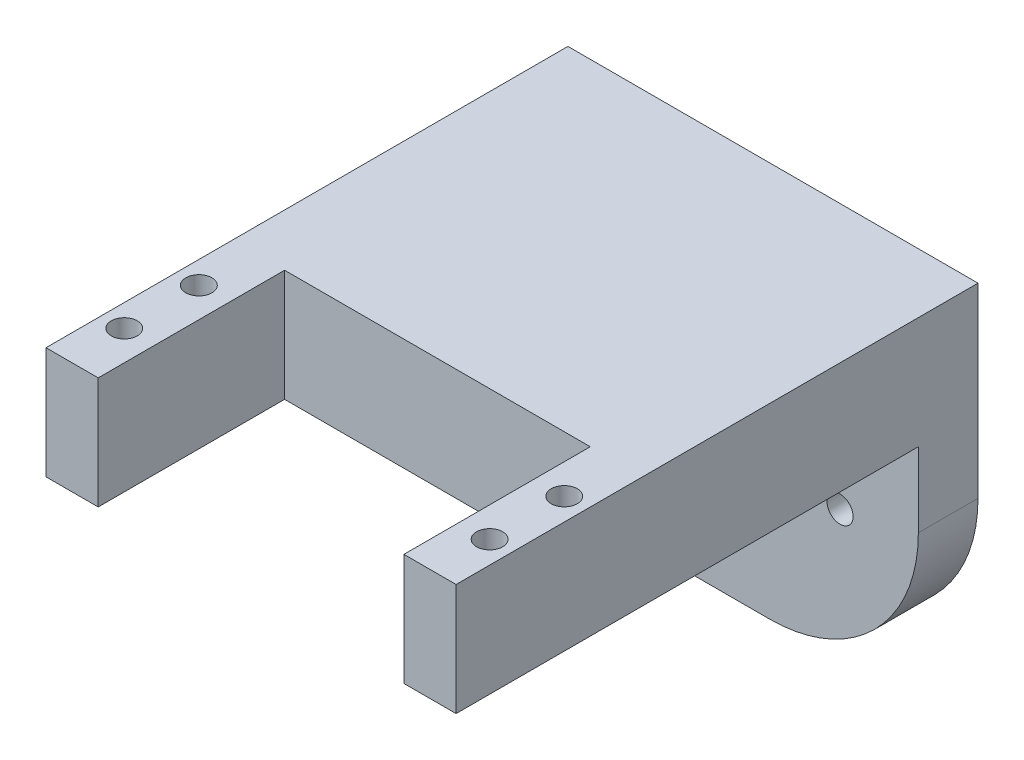
ISO-10303-21;
HEADER;
FILE_DESCRIPTION(('STEP AP214'),'2;1');
FILE_NAME('part.step','',(''),(''),'','','');
FILE_SCHEMA(('AUTOMOTIVE_DESIGN { 1 0 10303 214 1 1 1 1 }'));
ENDSEC;
DATA;
#1=APPLICATION_CONTEXT('core data for automotive mechanical design processes');
#2=APPLICATION_PROTOCOL_DEFINITION('international standard','automotive_design',2000,#1);
#3=PRODUCT_CONTEXT('',#1,'mechanical');
#4=PRODUCT('Part','Part','',(#3));
#5=PRODUCT_RELATED_PRODUCT_CATEGORY('part','',(#4));
#6=PRODUCT_DEFINITION_FORMATION('','',#4);
#7=PRODUCT_DEFINITION_CONTEXT('part definition',#1,'design');
#8=PRODUCT_DEFINITION('design','',#6,#7);
#9=PRODUCT_DEFINITION_SHAPE('','',#8);
#10=(LENGTH_UNIT() NAMED_UNIT(*) SI_UNIT(.MILLI.,.METRE.));
#11=(NAMED_UNIT(*) PLANE_ANGLE_UNIT() SI_UNIT($,.RADIAN.));
#12=(NAMED_UNIT(*) SI_UNIT($,.STERADIAN.) SOLID_ANGLE_UNIT());
#13=UNCERTAINTY_MEASURE_WITH_UNIT(LENGTH_MEASURE(1.E-05),#10,'distance_accuracy_value','');
#14=(GEOMETRIC_REPRESENTATION_CONTEXT(3) GLOBAL_UNCERTAINTY_ASSIGNED_CONTEXT((#13)) GLOBAL_UNIT_ASSIGNED_CONTEXT((#10,
#11,#12)) REPRESENTATION_CONTEXT('',''));
#15=CARTESIAN_POINT('',(0.,0.,0.));
#16=DIRECTION('',(0.,0.,1.));
#17=DIRECTION('',(1.,0.,0.));
#18=AXIS2_PLACEMENT_3D('',#15,#16,#17);
#19=CARTESIAN_POINT('',(0.,0.,70.));
#20=DIRECTION('',(0.,0.,1.));
#21=DIRECTION('',(1.,0.,0.));
#22=AXIS2_PLACEMENT_3D('',#19,#20,#21);
#23=PLANE('',#22);
#24=DIRECTION('',(0.,1.,0.));
#25=VECTOR('',#24,1.);
#26=CARTESIAN_POINT('',(20.5,7.5,70.));
#27=LINE('',#26,#25);
#28=CARTESIAN_POINT('',(20.5,-7.5,70.));
#29=VERTEX_POINT('',#28);
#30=CARTESIAN_POINT('',(20.5,7.5,70.));
#31=VERTEX_POINT('',#30);
#32=EDGE_CURVE('E282',#29,#31,#27,.T.);
#33=ORIENTED_EDGE('',*,*,#32,.F.);
#34=DIRECTION('',(1.,0.,0.));
#35=VECTOR('',#34,1.);
#36=CARTESIAN_POINT('',(-27.5,-7.5,70.));
#37=LINE('',#36,#35);
#38=CARTESIAN_POINT('',(27.5,-7.5,70.));
#39=VERTEX_POINT('',#38);
#40=EDGE_CURVE('E321',#29,#39,#37,.T.);
#41=ORIENTED_EDGE('',*,*,#40,.T.);
#42=DIRECTION('',(0.,1.,0.));
#43=VECTOR('',#42,1.);
#44=CARTESIAN_POINT('',(27.5,7.5,70.));
#45=LINE('',#44,#43);
#46=CARTESIAN_POINT('',(27.5,7.5,70.));
#47=VERTEX_POINT('',#46);
#48=EDGE_CURVE('E311',#39,#47,#45,.T.);
#49=ORIENTED_EDGE('',*,*,#48,.T.);
#50=DIRECTION('',(-1.,0.,0.));
#51=VECTOR('',#50,1.);
#52=CARTESIAN_POINT('',(-27.5,7.5,70.));
#53=LINE('',#52,#51);
#54=EDGE_CURVE('E316',#47,#31,#53,.T.);
#55=ORIENTED_EDGE('',*,*,#54,.T.);
#56=EDGE_LOOP('',(#33,#41,#49,#55));
#57=FACE_BOUND('',#56,.T.);
#58=ADVANCED_FACE('F37',(#57),#23,.T.);
#59=CARTESIAN_POINT('',(27.5,7.5,70.));
#60=DIRECTION('',(-1.,0.,0.));
#61=DIRECTION('',(0.,-1.,0.));
#62=AXIS2_PLACEMENT_3D('',#59,#60,#61);
#63=PLANE('',#62);
#64=DIRECTION('',(0.,1.,0.));
#65=VECTOR('',#64,1.);
#66=CARTESIAN_POINT('',(27.5,-37.5,8.));
#67=LINE('',#66,#65);
#68=CARTESIAN_POINT('',(27.5,-17.5,8.));
#69=VERTEX_POINT('',#68);
#70=CARTESIAN_POINT('',(27.5,-7.5,8.));
#71=VERTEX_POINT('',#70);
#72=EDGE_CURVE('E257',#69,#71,#67,.T.);
#73=ORIENTED_EDGE('',*,*,#72,.F.);
#74=DIRECTION('',(0.,0.,-1.));
#75=VECTOR('',#74,1.);
#76=CARTESIAN_POINT('',(27.5,-17.5,70.));
#77=LINE('',#76,#75);
#78=CARTESIAN_POINT('',(27.5,-17.5,0.));
#79=VERTEX_POINT('',#78);
#80=EDGE_CURVE('E342',#69,#79,#77,.T.);
#81=ORIENTED_EDGE('',*,*,#80,.T.);
#82=DIRECTION('',(0.,1.,0.));
#83=VECTOR('',#82,1.);
#84=CARTESIAN_POINT('',(27.5,7.5,0.));
#85=LINE('',#84,#83);
#86=CARTESIAN_POINT('',(27.5,7.5,0.));
#87=VERTEX_POINT('',#86);
#88=EDGE_CURVE('E303',#79,#87,#85,.T.);
#89=ORIENTED_EDGE('',*,*,#88,.T.);
#90=DIRECTION('',(0.,0.,-1.));
#91=VECTOR('',#90,1.);
#92=CARTESIAN_POINT('',(27.5,7.5,70.));
#93=LINE('',#92,#91);
#94=EDGE_CURVE('E339',#47,#87,#93,.T.);
#95=ORIENTED_EDGE('',*,*,#94,.F.);
#96=ORIENTED_EDGE('',*,*,#48,.F.);
#97=DIRECTION('',(0.,0.,-1.));
#98=VECTOR('',#97,1.);
#99=CARTESIAN_POINT('',(27.5,-7.5,70.));
#100=LINE('',#99,#98);
#101=EDGE_CURVE('E325',#39,#71,#100,.T.);
#102=ORIENTED_EDGE('',*,*,#101,.T.);
#103=EDGE_LOOP('',(#73,#81,#89,#95,#96,#102));
#104=FACE_BOUND('',#103,.T.);
#105=ADVANCED_FACE('F363',(#104),#63,.F.);
#106=CARTESIAN_POINT('',(-27.5,7.5,70.));
#107=DIRECTION('',(0.,-1.,0.));
#108=DIRECTION('',(0.,0.,-1.));
#109=AXIS2_PLACEMENT_3D('',#106,#107,#108);
#110=PLANE('',#109);
#111=CARTESIAN_POINT('',(24.5,7.5,62.5));
#112=DIRECTION('',(0.,1.,0.));
#113=DIRECTION('',(0.,0.,1.));
#114=AXIS2_PLACEMENT_3D('',#111,#112,#113);
#115=CIRCLE('',#114,1.75);
#116=CARTESIAN_POINT('',(24.5,7.5,64.25));
#117=VERTEX_POINT('',#116);
#118=EDGE_CURVE('E267',#117,#117,#115,.T.);
#119=ORIENTED_EDGE('',*,*,#118,.F.);
#120=EDGE_LOOP('',(#119));
#121=FACE_BOUND('',#120,.T.);
#122=CARTESIAN_POINT('',(-24.5,7.5,52.5));
#123=DIRECTION('',(0.,1.,0.));
#124=DIRECTION('',(0.,0.,1.));
#125=AXIS2_PLACEMENT_3D('',#122,#123,#124);
#126=CIRCLE('',#125,1.75);
#127=CARTESIAN_POINT('',(-24.5,7.5,54.25));
#128=VERTEX_POINT('',#127);
#129=EDGE_CURVE('E274',#128,#128,#126,.T.);
#130=ORIENTED_EDGE('',*,*,#129,.F.);
#131=EDGE_LOOP('',(#130));
#132=FACE_BOUND('',#131,.T.);
#133=CARTESIAN_POINT('',(24.5,7.5,52.5));
#134=DIRECTION('',(0.,1.,0.));
#135=DIRECTION('',(0.,0.,1.));
#136=AXIS2_PLACEMENT_3D('',#133,#134,#135);
#137=CIRCLE('',#136,1.75);
#138=CARTESIAN_POINT('',(24.5,7.5,54.25));
#139=VERTEX_POINT('',#138);
#140=EDGE_CURVE('E261',#139,#139,#137,.T.);
#141=ORIENTED_EDGE('',*,*,#140,.F.);
#142=EDGE_LOOP('',(#141));
#143=FACE_BOUND('',#142,.T.);
#144=CARTESIAN_POINT('',(-24.5,7.5,62.5));
#145=DIRECTION('',(0.,1.,0.));
#146=DIRECTION('',(0.,0.,1.));
#147=AXIS2_PLACEMENT_3D('',#144,#145,#146);
#148=CIRCLE('',#147,1.75);
#149=CARTESIAN_POINT('',(-24.5,7.5,64.25));
#150=VERTEX_POINT('',#149);
#151=EDGE_CURVE('E270',#150,#150,#148,.T.);
#152=ORIENTED_EDGE('',*,*,#151,.F.);
#153=EDGE_LOOP('',(#152));
#154=FACE_BOUND('',#153,.T.);
#155=DIRECTION('',(-1.,0.,0.));
#156=VECTOR('',#155,1.);
#157=CARTESIAN_POINT('',(-20.5,7.5,45.));
#158=LINE('',#157,#156);
#159=CARTESIAN_POINT('',(20.5,7.5,45.));
#160=VERTEX_POINT('',#159);
#161=CARTESIAN_POINT('',(-20.5,7.5,45.));
#162=VERTEX_POINT('',#161);
#163=EDGE_CURVE('E288',#160,#162,#158,.T.);
#164=ORIENTED_EDGE('',*,*,#163,.F.);
#165=DIRECTION('',(0.,0.,1.));
#166=VECTOR('',#165,1.);
#167=CARTESIAN_POINT('',(20.5,7.5,45.));
#168=LINE('',#167,#166);
#169=EDGE_CURVE('E298',#160,#31,#168,.T.);
#170=ORIENTED_EDGE('',*,*,#169,.T.);
#171=ORIENTED_EDGE('',*,*,#54,.F.);
#172=ORIENTED_EDGE('',*,*,#94,.T.);
#173=DIRECTION('',(-1.,0.,0.));
#174=VECTOR('',#173,1.);
#175=CARTESIAN_POINT('',(-27.5,7.5,0.));
#176=LINE('',#175,#174);
#177=CARTESIAN_POINT('',(-27.5,7.5,0.));
#178=VERTEX_POINT('',#177);
#179=EDGE_CURVE('E327',#87,#178,#176,.T.);
#180=ORIENTED_EDGE('',*,*,#179,.T.);
#181=DIRECTION('',(0.,0.,-1.));
#182=VECTOR('',#181,1.);
#183=CARTESIAN_POINT('',(-27.5,7.5,70.));
#184=LINE('',#183,#182);
#185=CARTESIAN_POINT('',(-27.5,7.5,70.));
#186=VERTEX_POINT('',#185);
#187=EDGE_CURVE('E336',#186,#178,#184,.T.);
#188=ORIENTED_EDGE('',*,*,#187,.F.);
#189=CARTESIAN_POINT('',(-20.5,7.5,70.));
#190=VERTEX_POINT('',#189);
#191=EDGE_CURVE('E314',#190,#186,#53,.T.);
#192=ORIENTED_EDGE('',*,*,#191,.F.);
#193=DIRECTION('',(0.,0.,1.));
#194=VECTOR('',#193,1.);
#195=CARTESIAN_POINT('',(-20.5,7.5,45.));
#196=LINE('',#195,#194);
#197=EDGE_CURVE('E307',#162,#190,#196,.T.);
#198=ORIENTED_EDGE('',*,*,#197,.F.);
#199=EDGE_LOOP('',(#164,#170,#171,#172,#180,#188,#192,#198));
#200=FACE_BOUND('',#199,.T.);
#201=ADVANCED_FACE('F385',(#121,#132,#143,#154,#200),#110,.F.);
#202=CARTESIAN_POINT('',(-27.5,7.5,70.));
#203=DIRECTION('',(1.,0.,0.));
#204=DIRECTION('',(0.,1.,0.));
#205=AXIS2_PLACEMENT_3D('',#202,#203,#204);
#206=PLANE('',#205);
#207=DIRECTION('',(0.,-1.,0.));
#208=VECTOR('',#207,1.);
#209=CARTESIAN_POINT('',(-27.5,7.5,0.));
#210=LINE('',#209,#208);
#211=CARTESIAN_POINT('',(-27.5,-17.5,0.));
#212=VERTEX_POINT('',#211);
#213=EDGE_CURVE('E315',#178,#212,#210,.T.);
#214=ORIENTED_EDGE('',*,*,#213,.T.);
#215=DIRECTION('',(0.,0.,1.));
#216=VECTOR('',#215,1.);
#217=CARTESIAN_POINT('',(-27.5,-17.5,70.));
#218=LINE('',#217,#216);
#219=CARTESIAN_POINT('',(-27.5,-17.5,8.));
#220=VERTEX_POINT('',#219);
#221=EDGE_CURVE('E11',#212,#220,#218,.T.);
#222=ORIENTED_EDGE('',*,*,#221,.T.);
#223=DIRECTION('',(0.,1.,0.));
#224=VECTOR('',#223,1.);
#225=CARTESIAN_POINT('',(-27.5,-37.5,8.));
#226=LINE('',#225,#224);
#227=CARTESIAN_POINT('',(-27.5,-7.5,8.));
#228=VERTEX_POINT('',#227);
#229=EDGE_CURVE('E254',#220,#228,#226,.T.);
#230=ORIENTED_EDGE('',*,*,#229,.T.);
#231=DIRECTION('',(0.,0.,-1.));
#232=VECTOR('',#231,1.);
#233=CARTESIAN_POINT('',(-27.5,-7.5,70.));
#234=LINE('',#233,#232);
#235=CARTESIAN_POINT('',(-27.5,-7.5,70.));
#236=VERTEX_POINT('',#235);
#237=EDGE_CURVE('E333',#236,#228,#234,.T.);
#238=ORIENTED_EDGE('',*,*,#237,.F.);
#239=DIRECTION('',(0.,-1.,0.));
#240=VECTOR('',#239,1.);
#241=CARTESIAN_POINT('',(-27.5,7.5,70.));
#242=LINE('',#241,#240);
#243=EDGE_CURVE('E319',#186,#236,#242,.T.);
#244=ORIENTED_EDGE('',*,*,#243,.F.);
#245=ORIENTED_EDGE('',*,*,#187,.T.);
#246=EDGE_LOOP('',(#214,#222,#230,#238,#244,#245));
#247=FACE_BOUND('',#246,.T.);
#248=ADVANCED_FACE('F377',(#247),#206,.F.);
#249=CARTESIAN_POINT('',(-27.5,-7.5,70.));
#250=DIRECTION('',(0.,1.,0.));
#251=DIRECTION('',(0.,0.,1.));
#252=AXIS2_PLACEMENT_3D('',#249,#250,#251);
#253=PLANE('',#252);
#254=CARTESIAN_POINT('',(24.5,-7.5,62.5));
#255=DIRECTION('',(0.,1.,0.));
#256=DIRECTION('',(0.,0.,1.));
#257=AXIS2_PLACEMENT_3D('',#254,#255,#256);
#258=CIRCLE('',#257,1.75);
#259=CARTESIAN_POINT('',(24.5,-7.5,64.25));
#260=VERTEX_POINT('',#259);
#261=EDGE_CURVE('E271',#260,#260,#258,.T.);
#262=ORIENTED_EDGE('',*,*,#261,.T.);
#263=EDGE_LOOP('',(#262));
#264=FACE_BOUND('',#263,.T.);
#265=CARTESIAN_POINT('',(-24.5,-7.5,52.5));
#266=DIRECTION('',(0.,1.,0.));
#267=DIRECTION('',(0.,0.,1.));
#268=AXIS2_PLACEMENT_3D('',#265,#266,#267);
#269=CIRCLE('',#268,1.75);
#270=CARTESIAN_POINT('',(-24.5,-7.5,54.25));
#271=VERTEX_POINT('',#270);
#272=EDGE_CURVE('E264',#271,#271,#269,.T.);
#273=ORIENTED_EDGE('',*,*,#272,.T.);
#274=EDGE_LOOP('',(#273));
#275=FACE_BOUND('',#274,.T.);
#276=CARTESIAN_POINT('',(24.5,-7.5,52.5));
#277=DIRECTION('',(0.,1.,0.));
#278=DIRECTION('',(0.,0.,1.));
#279=AXIS2_PLACEMENT_3D('',#276,#277,#278);
#280=CIRCLE('',#279,1.75);
#281=CARTESIAN_POINT('',(24.5,-7.5,54.25));
#282=VERTEX_POINT('',#281);
#283=EDGE_CURVE('E259',#282,#282,#280,.T.);
#284=ORIENTED_EDGE('',*,*,#283,.T.);
#285=EDGE_LOOP('',(#284));
#286=FACE_BOUND('',#285,.T.);
#287=CARTESIAN_POINT('',(-24.5,-7.5,62.5));
#288=DIRECTION('',(0.,1.,0.));
#289=DIRECTION('',(0.,0.,1.));
#290=AXIS2_PLACEMENT_3D('',#287,#288,#289);
#291=CIRCLE('',#290,1.75);
#292=CARTESIAN_POINT('',(-24.5,-7.5,64.25));
#293=VERTEX_POINT('',#292);
#294=EDGE_CURVE('E279',#293,#293,#291,.T.);
#295=ORIENTED_EDGE('',*,*,#294,.T.);
#296=EDGE_LOOP('',(#295));
#297=FACE_BOUND('',#296,.T.);
#298=ORIENTED_EDGE('',*,*,#237,.T.);
#299=DIRECTION('',(1.,0.,0.));
#300=VECTOR('',#299,1.);
#301=CARTESIAN_POINT('',(-27.5,-7.5,8.));
#302=LINE('',#301,#300);
#303=EDGE_CURVE('E236',#228,#71,#302,.T.);
#304=ORIENTED_EDGE('',*,*,#303,.T.);
#305=ORIENTED_EDGE('',*,*,#101,.F.);
#306=ORIENTED_EDGE('',*,*,#40,.F.);
#307=DIRECTION('',(0.,0.,1.));
#308=VECTOR('',#307,1.);
#309=CARTESIAN_POINT('',(20.5,-7.5,45.));
#310=LINE('',#309,#308);
#311=CARTESIAN_POINT('',(20.5,-7.5,45.));
#312=VERTEX_POINT('',#311);
#313=EDGE_CURVE('E301',#312,#29,#310,.T.);
#314=ORIENTED_EDGE('',*,*,#313,.F.);
#315=DIRECTION('',(1.,0.,0.));
#316=VECTOR('',#315,1.);
#317=CARTESIAN_POINT('',(-20.5,-7.5,45.));
#318=LINE('',#317,#316);
#319=CARTESIAN_POINT('',(-20.5,-7.5,45.));
#320=VERTEX_POINT('',#319);
#321=EDGE_CURVE('E295',#320,#312,#318,.T.);
#322=ORIENTED_EDGE('',*,*,#321,.F.);
#323=DIRECTION('',(0.,0.,1.));
#324=VECTOR('',#323,1.);
#325=CARTESIAN_POINT('',(-20.5,-7.5,45.));
#326=LINE('',#325,#324);
#327=CARTESIAN_POINT('',(-20.5,-7.5,70.));
#328=VERTEX_POINT('',#327);
#329=EDGE_CURVE('E304',#320,#328,#326,.T.);
#330=ORIENTED_EDGE('',*,*,#329,.T.);
#331=EDGE_CURVE('E322',#236,#328,#37,.T.);
#332=ORIENTED_EDGE('',*,*,#331,.F.);
#333=EDGE_LOOP('',(#298,#304,#305,#306,#314,#322,#330,#332));
#334=FACE_BOUND('',#333,.T.);
#335=ADVANCED_FACE('F393',(#264,#275,#286,#297,#334),#253,.F.);
#336=DIRECTION('',(0.,-1.,0.));
#337=VECTOR('',#336,1.);
#338=CARTESIAN_POINT('',(-20.5,7.5,70.));
#339=LINE('',#338,#337);
#340=EDGE_CURVE('E289',#190,#328,#339,.T.);
#341=ORIENTED_EDGE('',*,*,#340,.F.);
#342=ORIENTED_EDGE('',*,*,#191,.T.);
#343=ORIENTED_EDGE('',*,*,#243,.T.);
#344=ORIENTED_EDGE('',*,*,#331,.T.);
#345=EDGE_LOOP('',(#341,#342,#343,#344));
#346=FACE_BOUND('',#345,.T.);
#347=ADVANCED_FACE('F398',(#346),#23,.T.);
#348=CARTESIAN_POINT('',(0.,0.,0.));
#349=DIRECTION('',(0.,0.,1.));
#350=DIRECTION('',(1.,0.,0.));
#351=AXIS2_PLACEMENT_3D('',#348,#349,#350);
#352=PLANE('',#351);
#353=DIRECTION('',(-0.984221987662164,-0.176938065441948,0.));
#354=VECTOR('',#353,1.);
#355=CARTESIAN_POINT('',(17.4777327766933,-22.6573993666878,0.));
#356=LINE('',#355,#354);
#357=CARTESIAN_POINT('',(17.4777327766933,-22.6573993666878,0.));
#358=VERTEX_POINT('',#357);
#359=CARTESIAN_POINT('',(3.3923680600744,-25.1895894775008,0.));
#360=VERTEX_POINT('',#359);
#361=EDGE_CURVE('E218',#358,#360,#356,.T.);
#362=ORIENTED_EDGE('',*,*,#361,.F.);
#363=CARTESIAN_POINT('',(17.,-20.,0.));
#364=DIRECTION('',(0.,0.,-1.));
#365=DIRECTION('',(-1.,0.,0.));
#366=AXIS2_PLACEMENT_3D('',#363,#364,#365);
#367=CIRCLE('',#366,2.7);
#368=CARTESIAN_POINT('',(17.4777327766933,-17.3426006333122,0.));
#369=VERTEX_POINT('',#368);
#370=EDGE_CURVE('E52',#369,#358,#367,.T.);
#371=ORIENTED_EDGE('',*,*,#370,.F.);
#372=DIRECTION('',(0.984221987662164,-0.176938065441948,0.));
#373=VECTOR('',#372,1.);
#374=CARTESIAN_POINT('',(17.4777327766933,-17.3426006333122,0.));
#375=LINE('',#374,#373);
#376=CARTESIAN_POINT('',(3.3923680600744,-14.8104105224992,0.));
#377=VERTEX_POINT('',#376);
#378=EDGE_CURVE('E195',#377,#369,#375,.T.);
#379=ORIENTED_EDGE('',*,*,#378,.F.);
#380=CARTESIAN_POINT('',(0.,-20.,0.));
#381=DIRECTION('',(0.,0.,-1.));
#382=DIRECTION('',(-1.,0.,0.));
#383=AXIS2_PLACEMENT_3D('',#380,#381,#382);
#384=CIRCLE('',#383,6.2);
#385=CARTESIAN_POINT('',(-3.39236806007439,-14.8104105224992,0.));
#386=VERTEX_POINT('',#385);
#387=EDGE_CURVE('E198',#386,#377,#384,.T.);
#388=ORIENTED_EDGE('',*,*,#387,.F.);
#389=DIRECTION('',(0.984221987662164,0.176938065441947,0.));
#390=VECTOR('',#389,1.);
#391=CARTESIAN_POINT('',(-17.4777327766933,-17.3426006333121,0.));
#392=LINE('',#391,#390);
#393=CARTESIAN_POINT('',(-17.4777327766933,-17.3426006333121,0.));
#394=VERTEX_POINT('',#393);
#395=EDGE_CURVE('E229',#394,#386,#392,.T.);
#396=ORIENTED_EDGE('',*,*,#395,.F.);
#397=CARTESIAN_POINT('',(-17.,-20.,0.));
#398=DIRECTION('',(0.,0.,-1.));
#399=DIRECTION('',(-1.,0.,0.));
#400=AXIS2_PLACEMENT_3D('',#397,#398,#399);
#401=CIRCLE('',#400,2.7);
#402=CARTESIAN_POINT('',(-17.4777327766933,-22.6573993666878,0.));
#403=VERTEX_POINT('',#402);
#404=EDGE_CURVE('E226',#403,#394,#401,.T.);
#405=ORIENTED_EDGE('',*,*,#404,.F.);
#406=DIRECTION('',(-0.984221987662164,0.176938065441948,0.));
#407=VECTOR('',#406,1.);
#408=CARTESIAN_POINT('',(-3.39236806007439,-25.1895894775008,0.));
#409=LINE('',#408,#407);
#410=CARTESIAN_POINT('',(-3.39236806007439,-25.1895894775008,0.));
#411=VERTEX_POINT('',#410);
#412=EDGE_CURVE('E223',#411,#403,#409,.T.);
#413=ORIENTED_EDGE('',*,*,#412,.F.);
#414=CARTESIAN_POINT('',(0.,-20.,0.));
#415=DIRECTION('',(0.,0.,-1.));
#416=DIRECTION('',(-1.,0.,0.));
#417=AXIS2_PLACEMENT_3D('',#414,#415,#416);
#418=CIRCLE('',#417,6.2);
#419=EDGE_CURVE('E220',#360,#411,#418,.T.);
#420=ORIENTED_EDGE('',*,*,#419,.F.);
#421=EDGE_LOOP('',(#362,#371,#379,#388,#396,#405,#413,#420));
#422=FACE_BOUND('',#421,.T.);
#423=ORIENTED_EDGE('',*,*,#88,.F.);
#424=CARTESIAN_POINT('',(7.50000000000001,-17.5,0.));
#425=DIRECTION('',(0.,0.,1.));
#426=DIRECTION('',(1.,0.,0.));
#427=AXIS2_PLACEMENT_3D('',#424,#425,#426);
#428=CIRCLE('',#427,20.);
#429=CARTESIAN_POINT('',(7.50000000000001,-37.5,0.));
#430=VERTEX_POINT('',#429);
#431=EDGE_CURVE('E347',#79,#430,#428,.F.);
#432=ORIENTED_EDGE('',*,*,#431,.T.);
#433=DIRECTION('',(-1.,0.,0.));
#434=VECTOR('',#433,1.);
#435=CARTESIAN_POINT('',(-27.5,-37.5,0.));
#436=LINE('',#435,#434);
#437=CARTESIAN_POINT('',(-7.49999999999999,-37.5,0.));
#438=VERTEX_POINT('',#437);
#439=EDGE_CURVE('E251',#430,#438,#436,.T.);
#440=ORIENTED_EDGE('',*,*,#439,.T.);
#441=CARTESIAN_POINT('',(-7.49999999999999,-17.5,0.));
#442=DIRECTION('',(0.,0.,1.));
#443=DIRECTION('',(1.,0.,0.));
#444=AXIS2_PLACEMENT_3D('',#441,#442,#443);
#445=CIRCLE('',#444,20.);
#446=EDGE_CURVE('E345',#438,#212,#445,.F.);
#447=ORIENTED_EDGE('',*,*,#446,.T.);
#448=ORIENTED_EDGE('',*,*,#213,.F.);
#449=ORIENTED_EDGE('',*,*,#179,.F.);
#450=EDGE_LOOP('',(#423,#432,#440,#447,#448,#449));
#451=FACE_BOUND('',#450,.T.);
#452=ADVANCED_FACE('F370',(#422,#451),#352,.F.);
#453=CARTESIAN_POINT('',(20.5,7.5,45.));
#454=DIRECTION('',(1.,0.,0.));
#455=DIRECTION('',(0.,0.,-1.));
#456=AXIS2_PLACEMENT_3D('',#453,#454,#455);
#457=PLANE('',#456);
#458=ORIENTED_EDGE('',*,*,#32,.T.);
#459=ORIENTED_EDGE('',*,*,#169,.F.);
#460=DIRECTION('',(0.,1.,0.));
#461=VECTOR('',#460,1.);
#462=CARTESIAN_POINT('',(20.5,7.5,45.));
#463=LINE('',#462,#461);
#464=EDGE_CURVE('E285',#312,#160,#463,.T.);
#465=ORIENTED_EDGE('',*,*,#464,.F.);
#466=ORIENTED_EDGE('',*,*,#313,.T.);
#467=EDGE_LOOP('',(#458,#459,#465,#466));
#468=FACE_BOUND('',#467,.T.);
#469=ADVANCED_FACE('F404',(#468),#457,.F.);
#470=CARTESIAN_POINT('',(-20.5,7.5,45.));
#471=DIRECTION('',(-1.,0.,0.));
#472=DIRECTION('',(0.,0.,1.));
#473=AXIS2_PLACEMENT_3D('',#470,#471,#472);
#474=PLANE('',#473);
#475=ORIENTED_EDGE('',*,*,#340,.T.);
#476=ORIENTED_EDGE('',*,*,#329,.F.);
#477=DIRECTION('',(0.,-1.,0.));
#478=VECTOR('',#477,1.);
#479=CARTESIAN_POINT('',(-20.5,7.5,45.));
#480=LINE('',#479,#478);
#481=EDGE_CURVE('E292',#162,#320,#480,.T.);
#482=ORIENTED_EDGE('',*,*,#481,.F.);
#483=ORIENTED_EDGE('',*,*,#197,.T.);
#484=EDGE_LOOP('',(#475,#476,#482,#483));
#485=FACE_BOUND('',#484,.T.);
#486=ADVANCED_FACE('F400',(#485),#474,.F.);
#487=CARTESIAN_POINT('',(0.,0.,45.));
#488=DIRECTION('',(0.,0.,1.));
#489=DIRECTION('',(1.,0.,0.));
#490=AXIS2_PLACEMENT_3D('',#487,#488,#489);
#491=PLANE('',#490);
#492=ORIENTED_EDGE('',*,*,#464,.T.);
#493=ORIENTED_EDGE('',*,*,#163,.T.);
#494=ORIENTED_EDGE('',*,*,#481,.T.);
#495=ORIENTED_EDGE('',*,*,#321,.T.);
#496=EDGE_LOOP('',(#492,#493,#494,#495));
#497=FACE_BOUND('',#496,.T.);
#498=ADVANCED_FACE('F402',(#497),#491,.T.);
#499=CARTESIAN_POINT('',(-24.5,-7.5,62.5));
#500=DIRECTION('',(0.,1.,0.));
#501=DIRECTION('',(0.,0.,1.));
#502=AXIS2_PLACEMENT_3D('',#499,#500,#501);
#503=CYLINDRICAL_SURFACE('',#502,1.75);
#504=ORIENTED_EDGE('',*,*,#294,.F.);
#505=EDGE_LOOP('',(#504));
#506=FACE_BOUND('',#505,.T.);
#507=ORIENTED_EDGE('',*,*,#151,.T.);
#508=EDGE_LOOP('',(#507));
#509=FACE_BOUND('',#508,.T.);
#510=ADVANCED_FACE('F455',(#506,#509),#503,.F.);
#511=CARTESIAN_POINT('',(24.5,-7.5,52.5));
#512=DIRECTION('',(0.,1.,0.));
#513=DIRECTION('',(0.,0.,1.));
#514=AXIS2_PLACEMENT_3D('',#511,#512,#513);
#515=CYLINDRICAL_SURFACE('',#514,1.75);
#516=ORIENTED_EDGE('',*,*,#283,.F.);
#517=EDGE_LOOP('',(#516));
#518=FACE_BOUND('',#517,.T.);
#519=ORIENTED_EDGE('',*,*,#140,.T.);
#520=EDGE_LOOP('',(#519));
#521=FACE_BOUND('',#520,.T.);
#522=ADVANCED_FACE('F451',(#518,#521),#515,.F.);
#523=CARTESIAN_POINT('',(-24.5,-7.5,52.5));
#524=DIRECTION('',(0.,1.,0.));
#525=DIRECTION('',(0.,0.,1.));
#526=AXIS2_PLACEMENT_3D('',#523,#524,#525);
#527=CYLINDRICAL_SURFACE('',#526,1.75);
#528=ORIENTED_EDGE('',*,*,#272,.F.);
#529=EDGE_LOOP('',(#528));
#530=FACE_BOUND('',#529,.T.);
#531=ORIENTED_EDGE('',*,*,#129,.T.);
#532=EDGE_LOOP('',(#531));
#533=FACE_BOUND('',#532,.T.);
#534=ADVANCED_FACE('F454',(#530,#533),#527,.F.);
#535=CARTESIAN_POINT('',(24.5,-7.5,62.5));
#536=DIRECTION('',(0.,1.,0.));
#537=DIRECTION('',(0.,0.,1.));
#538=AXIS2_PLACEMENT_3D('',#535,#536,#537);
#539=CYLINDRICAL_SURFACE('',#538,1.75);
#540=ORIENTED_EDGE('',*,*,#261,.F.);
#541=EDGE_LOOP('',(#540));
#542=FACE_BOUND('',#541,.T.);
#543=ORIENTED_EDGE('',*,*,#118,.T.);
#544=EDGE_LOOP('',(#543));
#545=FACE_BOUND('',#544,.T.);
#546=ADVANCED_FACE('F445',(#542,#545),#539,.F.);
#547=CARTESIAN_POINT('',(-27.5,-37.5,8.));
#548=DIRECTION('',(0.,0.,1.));
#549=DIRECTION('',(1.,0.,0.));
#550=AXIS2_PLACEMENT_3D('',#547,#548,#549);
#551=PLANE('',#550);
#552=CARTESIAN_POINT('',(17.,-20.,8.));
#553=DIRECTION('',(0.,0.,1.));
#554=DIRECTION('',(1.,0.,0.));
#555=AXIS2_PLACEMENT_3D('',#552,#553,#554);
#556=CIRCLE('',#555,1.75);
#557=CARTESIAN_POINT('',(18.75,-20.,8.));
#558=VERTEX_POINT('',#557);
#559=EDGE_CURVE('E201',#558,#558,#556,.T.);
#560=ORIENTED_EDGE('',*,*,#559,.F.);
#561=EDGE_LOOP('',(#560));
#562=FACE_BOUND('',#561,.T.);
#563=CARTESIAN_POINT('',(-17.,-20.,8.));
#564=DIRECTION('',(0.,0.,1.));
#565=DIRECTION('',(1.,0.,0.));
#566=AXIS2_PLACEMENT_3D('',#563,#564,#565);
#567=CIRCLE('',#566,1.75);
#568=CARTESIAN_POINT('',(-15.25,-20.,8.));
#569=VERTEX_POINT('',#568);
#570=EDGE_CURVE('E769',#569,#569,#567,.T.);
#571=ORIENTED_EDGE('',*,*,#570,.F.);
#572=EDGE_LOOP('',(#571));
#573=FACE_BOUND('',#572,.T.);
#574=CARTESIAN_POINT('',(0.,-20.,8.));
#575=DIRECTION('',(0.,0.,1.));
#576=DIRECTION('',(1.,0.,0.));
#577=AXIS2_PLACEMENT_3D('',#574,#575,#576);
#578=CIRCLE('',#577,1.75);
#579=CARTESIAN_POINT('',(1.75,-20.,8.));
#580=VERTEX_POINT('',#579);
#581=EDGE_CURVE('E767',#580,#580,#578,.T.);
#582=ORIENTED_EDGE('',*,*,#581,.F.);
#583=EDGE_LOOP('',(#582));
#584=FACE_BOUND('',#583,.T.);
#585=DIRECTION('',(1.,0.,0.));
#586=VECTOR('',#585,1.);
#587=CARTESIAN_POINT('',(-27.5,-37.5,8.));
#588=LINE('',#587,#586);
#589=CARTESIAN_POINT('',(-7.49999999999999,-37.5,8.));
#590=VERTEX_POINT('',#589);
#591=CARTESIAN_POINT('',(7.50000000000001,-37.5,8.));
#592=VERTEX_POINT('',#591);
#593=EDGE_CURVE('E248',#590,#592,#588,.T.);
#594=ORIENTED_EDGE('',*,*,#593,.T.);
#595=CARTESIAN_POINT('',(7.50000000000001,-17.5,8.));
#596=DIRECTION('',(0.,0.,1.));
#597=DIRECTION('',(1.,0.,0.));
#598=AXIS2_PLACEMENT_3D('',#595,#596,#597);
#599=CIRCLE('',#598,20.);
#600=EDGE_CURVE('E45',#592,#69,#599,.T.);
#601=ORIENTED_EDGE('',*,*,#600,.T.);
#602=ORIENTED_EDGE('',*,*,#72,.T.);
#603=ORIENTED_EDGE('',*,*,#303,.F.);
#604=ORIENTED_EDGE('',*,*,#229,.F.);
#605=CARTESIAN_POINT('',(-7.49999999999999,-17.5,8.));
#606=DIRECTION('',(0.,0.,1.));
#607=DIRECTION('',(1.,0.,0.));
#608=AXIS2_PLACEMENT_3D('',#605,#606,#607);
#609=CIRCLE('',#608,20.);
#610=EDGE_CURVE('E60',#220,#590,#609,.T.);
#611=ORIENTED_EDGE('',*,*,#610,.T.);
#612=EDGE_LOOP('',(#594,#601,#602,#603,#604,#611));
#613=FACE_BOUND('',#612,.T.);
#614=ADVANCED_FACE('F356',(#562,#573,#584,#613),#551,.T.);
#615=CARTESIAN_POINT('',(0.,-37.5,0.));
#616=DIRECTION('',(0.,1.,0.));
#617=DIRECTION('',(0.,0.,1.));
#618=AXIS2_PLACEMENT_3D('',#615,#616,#617);
#619=PLANE('',#618);
#620=ORIENTED_EDGE('',*,*,#439,.F.);
#621=DIRECTION('',(0.,0.,-1.));
#622=VECTOR('',#621,1.);
#623=CARTESIAN_POINT('',(7.50000000000001,-37.5,0.));
#624=LINE('',#623,#622);
#625=EDGE_CURVE('E351',#430,#592,#624,.F.);
#626=ORIENTED_EDGE('',*,*,#625,.T.);
#627=ORIENTED_EDGE('',*,*,#593,.F.);
#628=DIRECTION('',(0.,0.,1.));
#629=VECTOR('',#628,1.);
#630=CARTESIAN_POINT('',(-7.49999999999999,-37.5,0.));
#631=LINE('',#630,#629);
#632=EDGE_CURVE('E349',#590,#438,#631,.F.);
#633=ORIENTED_EDGE('',*,*,#632,.T.);
#634=EDGE_LOOP('',(#620,#626,#627,#633));
#635=FACE_BOUND('',#634,.T.);
#636=ADVANCED_FACE('F374',(#635),#619,.F.);
#637=CARTESIAN_POINT('',(7.50000000000001,-17.5,70.));
#638=DIRECTION('',(0.,0.,-1.));
#639=DIRECTION('',(-1.,0.,0.));
#640=AXIS2_PLACEMENT_3D('',#637,#638,#639);
#641=CYLINDRICAL_SURFACE('',#640,20.);
#642=ORIENTED_EDGE('',*,*,#600,.F.);
#643=ORIENTED_EDGE('',*,*,#625,.F.);
#644=ORIENTED_EDGE('',*,*,#431,.F.);
#645=ORIENTED_EDGE('',*,*,#80,.F.);
#646=EDGE_LOOP('',(#642,#643,#644,#645));
#647=FACE_BOUND('',#646,.T.);
#648=ADVANCED_FACE('F367',(#647),#641,.T.);
#649=CARTESIAN_POINT('',(-7.49999999999999,-17.5,70.));
#650=DIRECTION('',(0.,0.,1.));
#651=DIRECTION('',(1.,0.,0.));
#652=AXIS2_PLACEMENT_3D('',#649,#650,#651);
#653=CYLINDRICAL_SURFACE('',#652,20.);
#654=ORIENTED_EDGE('',*,*,#446,.F.);
#655=ORIENTED_EDGE('',*,*,#632,.F.);
#656=ORIENTED_EDGE('',*,*,#610,.F.);
#657=ORIENTED_EDGE('',*,*,#221,.F.);
#658=EDGE_LOOP('',(#654,#655,#656,#657));
#659=FACE_BOUND('',#658,.T.);
#660=ADVANCED_FACE('F39',(#659),#653,.T.);
#661=CARTESIAN_POINT('',(17.,-20.,3.));
#662=DIRECTION('',(0.,0.,-1.));
#663=DIRECTION('',(-1.,0.,0.));
#664=AXIS2_PLACEMENT_3D('',#661,#662,#663);
#665=CYLINDRICAL_SURFACE('',#664,2.7);
#666=ORIENTED_EDGE('',*,*,#370,.T.);
#667=DIRECTION('',(0.,0.,-1.));
#668=VECTOR('',#667,1.);
#669=CARTESIAN_POINT('',(17.4777327766933,-22.6573993666878,3.));
#670=LINE('',#669,#668);
#671=CARTESIAN_POINT('',(17.4777327766933,-22.6573993666878,3.));
#672=VERTEX_POINT('',#671);
#673=EDGE_CURVE('E172',#672,#358,#670,.T.);
#674=ORIENTED_EDGE('',*,*,#673,.F.);
#675=CARTESIAN_POINT('',(17.,-20.,3.));
#676=DIRECTION('',(0.,0.,-1.));
#677=DIRECTION('',(-1.,0.,0.));
#678=AXIS2_PLACEMENT_3D('',#675,#676,#677);
#679=CIRCLE('',#678,2.7);
#680=CARTESIAN_POINT('',(17.4777327766933,-17.3426006333122,3.));
#681=VERTEX_POINT('',#680);
#682=EDGE_CURVE('E176',#681,#672,#679,.T.);
#683=ORIENTED_EDGE('',*,*,#682,.F.);
#684=DIRECTION('',(0.,0.,-1.));
#685=VECTOR('',#684,1.);
#686=CARTESIAN_POINT('',(17.4777327766933,-17.3426006333122,3.));
#687=LINE('',#686,#685);
#688=EDGE_CURVE('E234',#681,#369,#687,.T.);
#689=ORIENTED_EDGE('',*,*,#688,.T.);
#690=EDGE_LOOP('',(#666,#674,#683,#689));
#691=FACE_BOUND('',#690,.T.);
#692=ADVANCED_FACE('F174',(#691),#665,.F.);
#693=CARTESIAN_POINT('',(17.4777327766933,-17.3426006333122,3.));
#694=DIRECTION('',(0.176938065441948,0.984221987662164,0.));
#695=DIRECTION('',(-0.984221987662164,0.176938065441948,0.));
#696=AXIS2_PLACEMENT_3D('',#693,#694,#695);
#697=PLANE('',#696);
#698=ORIENTED_EDGE('',*,*,#378,.T.);
#699=ORIENTED_EDGE('',*,*,#688,.F.);
#700=DIRECTION('',(0.984221987662164,-0.176938065441948,0.));
#701=VECTOR('',#700,1.);
#702=CARTESIAN_POINT('',(17.4777327766933,-17.3426006333122,3.));
#703=LINE('',#702,#701);
#704=CARTESIAN_POINT('',(3.3923680600744,-14.8104105224992,3.));
#705=VERTEX_POINT('',#704);
#706=EDGE_CURVE('E182',#705,#681,#703,.T.);
#707=ORIENTED_EDGE('',*,*,#706,.F.);
#708=DIRECTION('',(0.,0.,-1.));
#709=VECTOR('',#708,1.);
#710=CARTESIAN_POINT('',(3.3923680600744,-14.8104105224992,3.));
#711=LINE('',#710,#709);
#712=EDGE_CURVE('E237',#705,#377,#711,.T.);
#713=ORIENTED_EDGE('',*,*,#712,.T.);
#714=EDGE_LOOP('',(#698,#699,#707,#713));
#715=FACE_BOUND('',#714,.T.);
#716=ADVANCED_FACE('F611',(#715),#697,.F.);
#717=CARTESIAN_POINT('',(0.,-20.,3.));
#718=DIRECTION('',(0.,0.,-1.));
#719=DIRECTION('',(-1.,0.,0.));
#720=AXIS2_PLACEMENT_3D('',#717,#718,#719);
#721=CYLINDRICAL_SURFACE('',#720,6.2);
#722=ORIENTED_EDGE('',*,*,#387,.T.);
#723=ORIENTED_EDGE('',*,*,#712,.F.);
#724=CARTESIAN_POINT('',(0.,-20.,3.));
#725=DIRECTION('',(0.,0.,-1.));
#726=DIRECTION('',(-1.,0.,0.));
#727=AXIS2_PLACEMENT_3D('',#724,#725,#726);
#728=CIRCLE('',#727,6.2);
#729=CARTESIAN_POINT('',(-3.39236806007439,-14.8104105224992,3.));
#730=VERTEX_POINT('',#729);
#731=EDGE_CURVE('E214',#730,#705,#728,.T.);
#732=ORIENTED_EDGE('',*,*,#731,.F.);
#733=DIRECTION('',(0.,0.,-1.));
#734=VECTOR('',#733,1.);
#735=CARTESIAN_POINT('',(-3.39236806007439,-14.8104105224992,3.));
#736=LINE('',#735,#734);
#737=EDGE_CURVE('E239',#730,#386,#736,.T.);
#738=ORIENTED_EDGE('',*,*,#737,.T.);
#739=EDGE_LOOP('',(#722,#723,#732,#738));
#740=FACE_BOUND('',#739,.T.);
#741=ADVANCED_FACE('F601',(#740),#721,.F.);
#742=CARTESIAN_POINT('',(-17.4777327766933,-17.3426006333121,3.));
#743=DIRECTION('',(-0.176938065441947,0.984221987662164,0.));
#744=DIRECTION('',(-0.984221987662164,-0.176938065441947,0.));
#745=AXIS2_PLACEMENT_3D('',#742,#743,#744);
#746=PLANE('',#745);
#747=ORIENTED_EDGE('',*,*,#395,.T.);
#748=ORIENTED_EDGE('',*,*,#737,.F.);
#749=DIRECTION('',(0.984221987662164,0.176938065441947,0.));
#750=VECTOR('',#749,1.);
#751=CARTESIAN_POINT('',(-17.4777327766933,-17.3426006333121,3.));
#752=LINE('',#751,#750);
#753=CARTESIAN_POINT('',(-17.4777327766933,-17.3426006333121,3.));
#754=VERTEX_POINT('',#753);
#755=EDGE_CURVE('E211',#754,#730,#752,.T.);
#756=ORIENTED_EDGE('',*,*,#755,.F.);
#757=DIRECTION('',(0.,0.,-1.));
#758=VECTOR('',#757,1.);
#759=CARTESIAN_POINT('',(-17.4777327766933,-17.3426006333121,3.));
#760=LINE('',#759,#758);
#761=EDGE_CURVE('E241',#754,#394,#760,.T.);
#762=ORIENTED_EDGE('',*,*,#761,.T.);
#763=EDGE_LOOP('',(#747,#748,#756,#762));
#764=FACE_BOUND('',#763,.T.);
#765=ADVANCED_FACE('F591',(#764),#746,.F.);
#766=CARTESIAN_POINT('',(-17.,-20.,3.));
#767=DIRECTION('',(0.,0.,-1.));
#768=DIRECTION('',(-1.,0.,0.));
#769=AXIS2_PLACEMENT_3D('',#766,#767,#768);
#770=CYLINDRICAL_SURFACE('',#769,2.7);
#771=ORIENTED_EDGE('',*,*,#404,.T.);
#772=ORIENTED_EDGE('',*,*,#761,.F.);
#773=CARTESIAN_POINT('',(-17.,-20.,3.));
#774=DIRECTION('',(0.,0.,-1.));
#775=DIRECTION('',(-1.,0.,0.));
#776=AXIS2_PLACEMENT_3D('',#773,#774,#775);
#777=CIRCLE('',#776,2.7);
#778=CARTESIAN_POINT('',(-17.4777327766933,-22.6573993666878,3.));
#779=VERTEX_POINT('',#778);
#780=EDGE_CURVE('E208',#779,#754,#777,.T.);
#781=ORIENTED_EDGE('',*,*,#780,.F.);
#782=DIRECTION('',(0.,0.,-1.));
#783=VECTOR('',#782,1.);
#784=CARTESIAN_POINT('',(-17.4777327766933,-22.6573993666878,3.));
#785=LINE('',#784,#783);
#786=EDGE_CURVE('E243',#779,#403,#785,.T.);
#787=ORIENTED_EDGE('',*,*,#786,.T.);
#788=EDGE_LOOP('',(#771,#772,#781,#787));
#789=FACE_BOUND('',#788,.T.);
#790=ADVANCED_FACE('F581',(#789),#770,.F.);
#791=CARTESIAN_POINT('',(-3.39236806007439,-25.1895894775008,3.));
#792=DIRECTION('',(-0.176938065441948,-0.984221987662164,0.));
#793=DIRECTION('',(0.984221987662164,-0.176938065441948,0.));
#794=AXIS2_PLACEMENT_3D('',#791,#792,#793);
#795=PLANE('',#794);
#796=ORIENTED_EDGE('',*,*,#412,.T.);
#797=ORIENTED_EDGE('',*,*,#786,.F.);
#798=DIRECTION('',(-0.984221987662164,0.176938065441948,0.));
#799=VECTOR('',#798,1.);
#800=CARTESIAN_POINT('',(-3.39236806007439,-25.1895894775008,3.));
#801=LINE('',#800,#799);
#802=CARTESIAN_POINT('',(-3.39236806007439,-25.1895894775008,3.));
#803=VERTEX_POINT('',#802);
#804=EDGE_CURVE('E205',#803,#779,#801,.T.);
#805=ORIENTED_EDGE('',*,*,#804,.F.);
#806=DIRECTION('',(0.,0.,-1.));
#807=VECTOR('',#806,1.);
#808=CARTESIAN_POINT('',(-3.39236806007439,-25.1895894775008,3.));
#809=LINE('',#808,#807);
#810=EDGE_CURVE('E245',#803,#411,#809,.T.);
#811=ORIENTED_EDGE('',*,*,#810,.T.);
#812=EDGE_LOOP('',(#796,#797,#805,#811));
#813=FACE_BOUND('',#812,.T.);
#814=ADVANCED_FACE('F572',(#813),#795,.F.);
#815=CARTESIAN_POINT('',(0.,-20.,3.));
#816=DIRECTION('',(0.,0.,-1.));
#817=DIRECTION('',(-1.,0.,0.));
#818=AXIS2_PLACEMENT_3D('',#815,#816,#817);
#819=CYLINDRICAL_SURFACE('',#818,6.2);
#820=ORIENTED_EDGE('',*,*,#419,.T.);
#821=ORIENTED_EDGE('',*,*,#810,.F.);
#822=CARTESIAN_POINT('',(0.,-20.,3.));
#823=DIRECTION('',(0.,0.,-1.));
#824=DIRECTION('',(-1.,0.,0.));
#825=AXIS2_PLACEMENT_3D('',#822,#823,#824);
#826=CIRCLE('',#825,6.2);
#827=CARTESIAN_POINT('',(3.3923680600744,-25.1895894775008,3.));
#828=VERTEX_POINT('',#827);
#829=EDGE_CURVE('E190',#828,#803,#826,.T.);
#830=ORIENTED_EDGE('',*,*,#829,.F.);
#831=DIRECTION('',(0.,0.,-1.));
#832=VECTOR('',#831,1.);
#833=CARTESIAN_POINT('',(3.3923680600744,-25.1895894775008,3.));
#834=LINE('',#833,#832);
#835=EDGE_CURVE('E181',#828,#360,#834,.T.);
#836=ORIENTED_EDGE('',*,*,#835,.T.);
#837=EDGE_LOOP('',(#820,#821,#830,#836));
#838=FACE_BOUND('',#837,.T.);
#839=ADVANCED_FACE('F565',(#838),#819,.F.);
#840=CARTESIAN_POINT('',(17.4777327766933,-22.6573993666878,3.));
#841=DIRECTION('',(0.176938065441948,-0.984221987662164,0.));
#842=DIRECTION('',(0.984221987662164,0.176938065441948,0.));
#843=AXIS2_PLACEMENT_3D('',#840,#841,#842);
#844=PLANE('',#843);
#845=ORIENTED_EDGE('',*,*,#361,.T.);
#846=ORIENTED_EDGE('',*,*,#835,.F.);
#847=DIRECTION('',(-0.984221987662164,-0.176938065441948,0.));
#848=VECTOR('',#847,1.);
#849=CARTESIAN_POINT('',(17.4777327766933,-22.6573993666878,3.));
#850=LINE('',#849,#848);
#851=EDGE_CURVE('E185',#672,#828,#850,.T.);
#852=ORIENTED_EDGE('',*,*,#851,.F.);
#853=ORIENTED_EDGE('',*,*,#673,.T.);
#854=EDGE_LOOP('',(#845,#846,#852,#853));
#855=FACE_BOUND('',#854,.T.);
#856=ADVANCED_FACE('F186',(#855),#844,.F.);
#857=CARTESIAN_POINT('',(17.,-20.,3.));
#858=DIRECTION('',(0.,0.,-1.));
#859=DIRECTION('',(-1.,0.,0.));
#860=AXIS2_PLACEMENT_3D('',#857,#858,#859);
#861=PLANE('',#860);
#862=CARTESIAN_POINT('',(17.,-20.,3.));
#863=DIRECTION('',(0.,0.,-1.));
#864=DIRECTION('',(-1.,0.,0.));
#865=AXIS2_PLACEMENT_3D('',#862,#863,#864);
#866=CIRCLE('',#865,1.75);
#867=CARTESIAN_POINT('',(15.25,-20.,3.));
#868=VERTEX_POINT('',#867);
#869=EDGE_CURVE('E758',#868,#868,#866,.T.);
#870=ORIENTED_EDGE('',*,*,#869,.F.);
#871=EDGE_LOOP('',(#870));
#872=FACE_BOUND('',#871,.T.);
#873=CARTESIAN_POINT('',(-17.,-20.,3.));
#874=DIRECTION('',(0.,0.,-1.));
#875=DIRECTION('',(-1.,0.,0.));
#876=AXIS2_PLACEMENT_3D('',#873,#874,#875);
#877=CIRCLE('',#876,1.75);
#878=CARTESIAN_POINT('',(-18.75,-20.,3.));
#879=VERTEX_POINT('',#878);
#880=EDGE_CURVE('E759',#879,#879,#877,.T.);
#881=ORIENTED_EDGE('',*,*,#880,.F.);
#882=EDGE_LOOP('',(#881));
#883=FACE_BOUND('',#882,.T.);
#884=CARTESIAN_POINT('',(0.,-20.,3.));
#885=DIRECTION('',(0.,0.,-1.));
#886=DIRECTION('',(-1.,0.,0.));
#887=AXIS2_PLACEMENT_3D('',#884,#885,#886);
#888=CIRCLE('',#887,1.75);
#889=CARTESIAN_POINT('',(-1.75,-20.,3.));
#890=VERTEX_POINT('',#889);
#891=EDGE_CURVE('E762',#890,#890,#888,.T.);
#892=ORIENTED_EDGE('',*,*,#891,.F.);
#893=EDGE_LOOP('',(#892));
#894=FACE_BOUND('',#893,.T.);
#895=ORIENTED_EDGE('',*,*,#682,.T.);
#896=ORIENTED_EDGE('',*,*,#851,.T.);
#897=ORIENTED_EDGE('',*,*,#829,.T.);
#898=ORIENTED_EDGE('',*,*,#804,.T.);
#899=ORIENTED_EDGE('',*,*,#780,.T.);
#900=ORIENTED_EDGE('',*,*,#755,.T.);
#901=ORIENTED_EDGE('',*,*,#731,.T.);
#902=ORIENTED_EDGE('',*,*,#706,.T.);
#903=EDGE_LOOP('',(#895,#896,#897,#898,#899,#900,#901,#902));
#904=FACE_BOUND('',#903,.T.);
#905=ADVANCED_FACE('F192',(#872,#883,#894,#904),#861,.T.);
#906=CARTESIAN_POINT('',(0.,-20.,70.));
#907=DIRECTION('',(0.,0.,-1.));
#908=DIRECTION('',(-1.,0.,0.));
#909=AXIS2_PLACEMENT_3D('',#906,#907,#908);
#910=CYLINDRICAL_SURFACE('',#909,1.75);
#911=ORIENTED_EDGE('',*,*,#581,.T.);
#912=EDGE_LOOP('',(#911));
#913=FACE_BOUND('',#912,.T.);
#914=ORIENTED_EDGE('',*,*,#891,.T.);
#915=EDGE_LOOP('',(#914));
#916=FACE_BOUND('',#915,.T.);
#917=ADVANCED_FACE('F520',(#913,#916),#910,.F.);
#918=CARTESIAN_POINT('',(-17.,-20.,70.));
#919=DIRECTION('',(0.,0.,-1.));
#920=DIRECTION('',(-1.,0.,0.));
#921=AXIS2_PLACEMENT_3D('',#918,#919,#920);
#922=CYLINDRICAL_SURFACE('',#921,1.75);
#923=ORIENTED_EDGE('',*,*,#570,.T.);
#924=EDGE_LOOP('',(#923));
#925=FACE_BOUND('',#924,.T.);
#926=ORIENTED_EDGE('',*,*,#880,.T.);
#927=EDGE_LOOP('',(#926));
#928=FACE_BOUND('',#927,.T.);
#929=ADVANCED_FACE('F531',(#925,#928),#922,.F.);
#930=CARTESIAN_POINT('',(17.,-20.,70.));
#931=DIRECTION('',(0.,0.,-1.));
#932=DIRECTION('',(-1.,0.,0.));
#933=AXIS2_PLACEMENT_3D('',#930,#931,#932);
#934=CYLINDRICAL_SURFACE('',#933,1.75);
#935=ORIENTED_EDGE('',*,*,#559,.T.);
#936=EDGE_LOOP('',(#935));
#937=FACE_BOUND('',#936,.T.);
#938=ORIENTED_EDGE('',*,*,#869,.T.);
#939=EDGE_LOOP('',(#938));
#940=FACE_BOUND('',#939,.T.);
#941=ADVANCED_FACE('F542',(#937,#940),#934,.F.);
#942=CLOSED_SHELL('',(#58,#105,#201,#248,#335,#347,#452,#469,#486,#498,#510,#522,#534,#546,#614,
#636,#648,#660,#692,#716,#741,#765,#790,#814,#839,#856,#905,#917,#929,#941));
#943=MANIFOLD_SOLID_BREP('B2',#942);
#944=ADVANCED_BREP_SHAPE_REPRESENTATION('',(#18,#943),#14);
#945=SHAPE_DEFINITION_REPRESENTATION(#9,#944);
ENDSEC;
END-ISO-10303-21;
